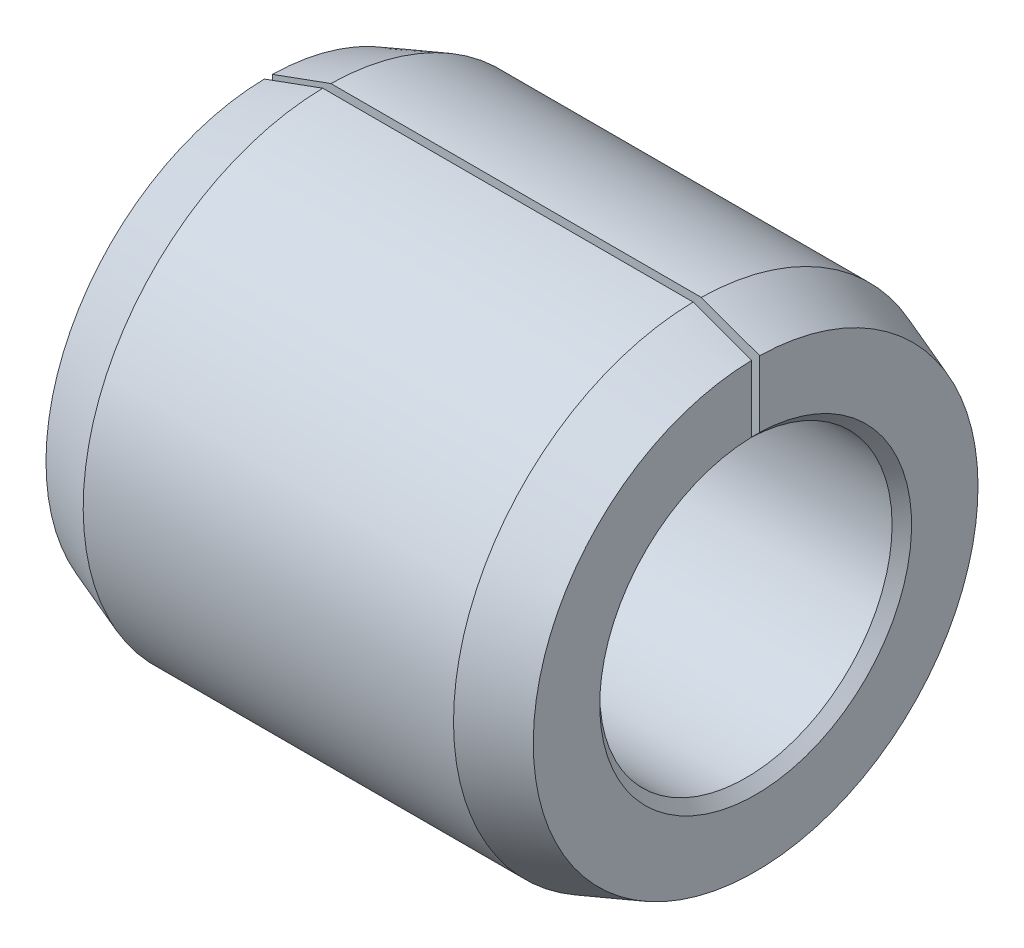
ISO-10303-21;
HEADER;
FILE_DESCRIPTION(('STEP AP214'),'2;1');
FILE_NAME('part.step','',(''),(''),'','','');
FILE_SCHEMA(('AUTOMOTIVE_DESIGN { 1 0 10303 214 1 1 1 1 }'));
ENDSEC;
DATA;
#1=APPLICATION_CONTEXT('core data for automotive mechanical design processes');
#2=APPLICATION_PROTOCOL_DEFINITION('international standard','automotive_design',2000,#1);
#3=PRODUCT_CONTEXT('',#1,'mechanical');
#4=PRODUCT('Part','Part','',(#3));
#5=PRODUCT_RELATED_PRODUCT_CATEGORY('part','',(#4));
#6=PRODUCT_DEFINITION_FORMATION('','',#4);
#7=PRODUCT_DEFINITION_CONTEXT('part definition',#1,'design');
#8=PRODUCT_DEFINITION('design','',#6,#7);
#9=PRODUCT_DEFINITION_SHAPE('','',#8);
#10=(LENGTH_UNIT() NAMED_UNIT(*) SI_UNIT(.MILLI.,.METRE.));
#11=(NAMED_UNIT(*) PLANE_ANGLE_UNIT() SI_UNIT($,.RADIAN.));
#12=(NAMED_UNIT(*) SI_UNIT($,.STERADIAN.) SOLID_ANGLE_UNIT());
#13=UNCERTAINTY_MEASURE_WITH_UNIT(LENGTH_MEASURE(1.E-05),#10,'distance_accuracy_value','');
#14=(GEOMETRIC_REPRESENTATION_CONTEXT(3) GLOBAL_UNCERTAINTY_ASSIGNED_CONTEXT((#13)) GLOBAL_UNIT_ASSIGNED_CONTEXT((#10,
#11,#12)) REPRESENTATION_CONTEXT('',''));
#15=CARTESIAN_POINT('',(0.,0.,0.));
#16=DIRECTION('',(0.,0.,1.));
#17=DIRECTION('',(1.,0.,0.));
#18=AXIS2_PLACEMENT_3D('',#15,#16,#17);
#19=CARTESIAN_POINT('',(5.,0.,0.));
#20=DIRECTION('',(-1.,0.,0.));
#21=DIRECTION('',(0.,0.,1.));
#22=AXIS2_PLACEMENT_3D('',#19,#20,#21);
#23=CONICAL_SURFACE('',#22,2.28161785944028,0.349065850398867);
#24=CARTESIAN_POINT('',(1.45040050652968,3.57332350022328,0.0416666666666667));
#25=CARTESIAN_POINT('',(2.55534017711682,3.17110124417373,0.0416666666666667));
#26=CARTESIAN_POINT('',(3.66029438435063,2.76891890558721,0.0416666666666667));
#27=CARTESIAN_POINT('',(5.31770499377719,2.16558853274691,0.0416666666666667));
#28=CARTESIAN_POINT('',(5.87017174696008,1.96446893087216,0.0416666666666667));
#29=CARTESIAN_POINT('',(6.97509126905575,1.56219131505674,0.0416666666666667));
#30=CARTESIAN_POINT('',(7.5275440379685,1.36103330111602,0.0416666666666667));
#31=CARTESIAN_POINT('',(8.07998627205942,1.15984635289,0.0416666666666667));
#32=B_SPLINE_CURVE_WITH_KNOTS('',3,(#24,#25,#26,#27,#28,#29,#30,#31),.UNSPECIFIED.,.F.,.F.,(4,2,
2,4),(0.,3.52761531923689,5.29142298063087,7.05523064483991),.UNSPECIFIED.);
#33=CARTESIAN_POINT('',(4.4,2.49965275366177,0.0416666666666667));
#34=VERTEX_POINT('',#33);
#35=CARTESIAN_POINT('',(5.,2.28123737156082,0.0416666666666667));
#36=VERTEX_POINT('',#35);
#37=EDGE_CURVE('E176',#34,#36,#32,.T.);
#38=ORIENTED_EDGE('',*,*,#37,.F.);
#39=CARTESIAN_POINT('',(4.4,0.,0.));
#40=DIRECTION('',(-1.,0.,0.));
#41=DIRECTION('',(0.,0.,1.));
#42=AXIS2_PLACEMENT_3D('',#39,#40,#41);
#43=CIRCLE('',#42,2.5);
#44=CARTESIAN_POINT('',(4.4,2.49965275366177,-0.0416666666666667));
#45=VERTEX_POINT('',#44);
#46=EDGE_CURVE('E145',#45,#34,#43,.T.);
#47=ORIENTED_EDGE('',*,*,#46,.F.);
#48=CARTESIAN_POINT('',(8.07998627205942,1.15984635289,-0.0416666666666667));
#49=CARTESIAN_POINT('',(7.53825103993999,1.35713424589462,-0.0416666666666667));
#50=CARTESIAN_POINT('',(6.99650563189232,1.55439419039098,-0.0416666666666667));
#51=CARTESIAN_POINT('',(5.89158664063263,1.9566732642235,-0.0416666666666667));
#52=CARTESIAN_POINT('',(5.32841250813325,2.161690884886,-0.0416666666666667));
#53=CARTESIAN_POINT('',(3.660294321265,2.76891873238838,-0.0416666666666667));
#54=CARTESIAN_POINT('',(2.55534005094122,3.17110089777766,-0.0416666666666667));
#55=CARTESIAN_POINT('',(1.45040050652968,3.57332350022328,-0.0416666666666667));
#56=B_SPLINE_CURVE_WITH_KNOTS('',3,(#48,#49,#50,#51,#52,#53,#54,#55),.UNSPECIFIED.,.F.,.F.,(4,2,
2,4),(0.,1.72962312537501,3.52761532563077,7.05523064486766),.UNSPECIFIED.);
#57=CARTESIAN_POINT('',(5.,2.28123737156082,-0.0416666666666667));
#58=VERTEX_POINT('',#57);
#59=EDGE_CURVE('E47',#58,#45,#56,.T.);
#60=ORIENTED_EDGE('',*,*,#59,.F.);
#61=CARTESIAN_POINT('',(5.,0.,0.));
#62=DIRECTION('',(-1.,0.,0.));
#63=DIRECTION('',(0.,0.,1.));
#64=AXIS2_PLACEMENT_3D('',#61,#62,#63);
#65=CIRCLE('',#64,2.28161785944028);
#66=EDGE_CURVE('E133',#58,#36,#65,.T.);
#67=ORIENTED_EDGE('',*,*,#66,.T.);
#68=EDGE_LOOP('',(#38,#47,#60,#67));
#69=FACE_BOUND('',#68,.T.);
#70=ADVANCED_FACE('F32',(#69),#23,.T.);
#71=CARTESIAN_POINT('',(5.,2.28161785944028,0.));
#72=DIRECTION('',(-1.,0.,0.));
#73=DIRECTION('',(0.,0.,1.));
#74=AXIS2_PLACEMENT_3D('',#71,#72,#73);
#75=PLANE('',#74);
#76=DIRECTION('',(0.,-1.,0.));
#77=VECTOR('',#76,1.);
#78=CARTESIAN_POINT('',(5.,0.,0.0416666666666667));
#79=LINE('',#78,#77);
#80=CARTESIAN_POINT('',(5.,1.5994573732641,0.0416666666666667));
#81=VERTEX_POINT('',#80);
#82=EDGE_CURVE('E105',#36,#81,#79,.T.);
#83=ORIENTED_EDGE('',*,*,#82,.F.);
#84=ORIENTED_EDGE('',*,*,#66,.F.);
#85=DIRECTION('',(0.,1.,0.));
#86=VECTOR('',#85,1.);
#87=CARTESIAN_POINT('',(5.,0.,-0.0416666666666667));
#88=LINE('',#87,#86);
#89=CARTESIAN_POINT('',(5.,1.5994573732641,-0.0416666666666667));
#90=VERTEX_POINT('',#89);
#91=EDGE_CURVE('E142',#90,#58,#88,.T.);
#92=ORIENTED_EDGE('',*,*,#91,.F.);
#93=CARTESIAN_POINT('',(5.,0.,0.));
#94=DIRECTION('',(-1.,0.,0.));
#95=DIRECTION('',(0.,0.,1.));
#96=AXIS2_PLACEMENT_3D('',#93,#94,#95);
#97=CIRCLE('',#96,1.6);
#98=EDGE_CURVE('E130',#90,#81,#97,.T.);
#99=ORIENTED_EDGE('',*,*,#98,.T.);
#100=EDGE_LOOP('',(#83,#84,#92,#99));
#101=FACE_BOUND('',#100,.T.);
#102=ADVANCED_FACE('F210',(#101),#75,.F.);
#103=CARTESIAN_POINT('',(4.9,0.,0.));
#104=DIRECTION('',(1.,0.,0.));
#105=DIRECTION('',(0.,0.,-1.));
#106=AXIS2_PLACEMENT_3D('',#103,#104,#105);
#107=CONICAL_SURFACE('',#106,1.5,0.785398163397447);
#108=CARTESIAN_POINT('',(6.09730448640509,2.69698264385774,0.0416666666666667));
#109=CARTESIAN_POINT('',(5.89362609187549,2.49327428649272,0.0416666666666667));
#110=CARTESIAN_POINT('',(5.68994553688047,2.28956808340359,0.0416666666666667));
#111=CARTESIAN_POINT('',(5.2825975056357,1.8821427164042,0.0416666666666667));
#112=CARTESIAN_POINT('',(5.07893002938226,1.67842355249763,0.0416666666666667));
#113=CARTESIAN_POINT('',(4.77345152579039,1.37282198595637,0.0416666666666667));
#114=CARTESIAN_POINT('',(4.67162911220893,1.27095096279189,0.0416666666666667));
#115=CARTESIAN_POINT('',(4.46799983174415,1.06719341917917,0.0416666666666667));
#116=CARTESIAN_POINT('',(4.3661929648569,0.965306898734846,0.0416666666666667));
#117=CARTESIAN_POINT('',(4.16261826646621,0.761494719920277,0.0416666666666667));
#118=CARTESIAN_POINT('',(4.06085043499734,0.659569061515512,0.0416666666666667));
#119=CARTESIAN_POINT('',(3.90828523322882,0.506593954385333,0.0416666666666667));
#120=CARTESIAN_POINT('',(3.85744455790888,0.455587782958239,0.0416666666666667));
#121=CARTESIAN_POINT('',(3.7558814194517,0.353457766491646,0.0416666666666667));
#122=CARTESIAN_POINT('',(3.7051589565313,0.302333921236636,0.0416666666666667));
#123=CARTESIAN_POINT('',(3.65454036427745,0.251106921321153,0.0416666666666667));
#124=B_SPLINE_CURVE_WITH_KNOTS('',3,(#108,#109,#110,#111,#112,#113,#114,#115,#116,#117,#118,
#119,#120,#121,#122,#123),.UNSPECIFIED.,.F.,.F.,(4,2,2,2,2,2,2,4),(0.,0.864197814810947,
1.72839538549356,2.16049443268804,2.59259337085687,3.02469269095485,3.24074262578335,
3.45679295660717),.UNSPECIFIED.);
#125=CARTESIAN_POINT('',(4.9,1.49942118462055,0.0416666666666667));
#126=VERTEX_POINT('',#125);
#127=EDGE_CURVE('E146',#81,#126,#124,.T.);
#128=ORIENTED_EDGE('',*,*,#127,.F.);
#129=ORIENTED_EDGE('',*,*,#98,.F.);
#130=CARTESIAN_POINT('',(3.65454036427745,0.251106921321153,-0.0416666666666667));
#131=CARTESIAN_POINT('',(3.68946046389026,0.286475381819245,-0.0416666666666667));
#132=CARTESIAN_POINT('',(3.72444534345725,0.32177959674711,-0.0416666666666667));
#133=CARTESIAN_POINT('',(3.79449191026719,0.392311665308783,-0.0416666666666667));
#134=CARTESIAN_POINT('',(3.82955359737814,0.427539519073606,-0.0416666666666667));
#135=CARTESIAN_POINT('',(4.00492184793209,0.60361788518926,-0.0416666666666667));
#136=CARTESIAN_POINT('',(4.14540972760643,0.744287571670683,-0.0416666666666667));
#137=CARTESIAN_POINT('',(4.42642572391524,1.02558711963001,-0.0416666666666667));
#138=CARTESIAN_POINT('',(4.56695384061804,1.16621698103946,-0.0416666666666667));
#139=CARTESIAN_POINT('',(4.76342165526093,1.36278654258166,-0.0416666666666667));
#140=CARTESIAN_POINT('',(4.81934915501475,1.41873841924396,-0.0416666666666667));
#141=CARTESIAN_POINT('',(5.07893042444409,1.67842280412153,-0.0416666666666667));
#142=CARTESIAN_POINT('',(5.28259743419495,1.88214207318682,-0.0416666666666667));
#143=CARTESIAN_POINT('',(5.68994489105734,2.28956800921552,-0.0416666666666667));
#144=CARTESIAN_POINT('',(5.89362533819547,2.49327467615233,-0.0416666666666667));
#145=CARTESIAN_POINT('',(6.09730448640509,2.69698264385774,-0.0416666666666667));
#146=B_SPLINE_CURVE_WITH_KNOTS('',3,(#130,#131,#132,#133,#134,#135,#136,#137,#138,#139,#140,
#141,#142,#143,#144,#145),.UNSPECIFIED.,.F.,.F.,(4,2,2,2,2,2,2,4),(0.,0.149107220578612,
0.298214185127435,0.894639389196668,1.49106561223056,1.72839761263271,2.59259442246702,
3.45679299812628),.UNSPECIFIED.);
#147=CARTESIAN_POINT('',(4.9,1.49942118462055,-0.0416666666666667));
#148=VERTEX_POINT('',#147);
#149=EDGE_CURVE('E198',#148,#90,#146,.T.);
#150=ORIENTED_EDGE('',*,*,#149,.F.);
#151=CARTESIAN_POINT('',(4.9,0.,0.));
#152=DIRECTION('',(-1.,0.,0.));
#153=DIRECTION('',(0.,0.,1.));
#154=AXIS2_PLACEMENT_3D('',#151,#152,#153);
#155=CIRCLE('',#154,1.5);
#156=EDGE_CURVE('E122',#148,#126,#155,.T.);
#157=ORIENTED_EDGE('',*,*,#156,.T.);
#158=EDGE_LOOP('',(#128,#129,#150,#157));
#159=FACE_BOUND('',#158,.T.);
#160=ADVANCED_FACE('F157',(#159),#107,.F.);
#161=CARTESIAN_POINT('',(0.,0.,0.));
#162=DIRECTION('',(-1.,0.,0.));
#163=DIRECTION('',(0.,0.,1.));
#164=AXIS2_PLACEMENT_3D('',#161,#162,#163);
#165=CYLINDRICAL_SURFACE('',#164,1.5);
#166=DIRECTION('',(-1.,0.,0.));
#167=VECTOR('',#166,1.);
#168=CARTESIAN_POINT('',(0.,1.49942118462055,0.0416666666666667));
#169=LINE('',#168,#167);
#170=CARTESIAN_POINT('',(0.0999999999999997,1.49942118462055,0.0416666666666667));
#171=VERTEX_POINT('',#170);
#172=EDGE_CURVE('E155',#126,#171,#169,.T.);
#173=ORIENTED_EDGE('',*,*,#172,.F.);
#174=ORIENTED_EDGE('',*,*,#156,.F.);
#175=DIRECTION('',(-1.,0.,0.));
#176=VECTOR('',#175,1.);
#177=CARTESIAN_POINT('',(0.,1.49942118462055,-0.0416666666666667));
#178=LINE('',#177,#176);
#179=CARTESIAN_POINT('',(0.0999999999999997,1.49942118462055,-0.0416666666666667));
#180=VERTEX_POINT('',#179);
#181=EDGE_CURVE('E116',#180,#148,#178,.F.);
#182=ORIENTED_EDGE('',*,*,#181,.F.);
#183=CARTESIAN_POINT('',(0.0999999999999997,0.,0.));
#184=DIRECTION('',(-1.,0.,0.));
#185=DIRECTION('',(0.,0.,1.));
#186=AXIS2_PLACEMENT_3D('',#183,#184,#185);
#187=CIRCLE('',#186,1.5);
#188=EDGE_CURVE('E115',#180,#171,#187,.T.);
#189=ORIENTED_EDGE('',*,*,#188,.T.);
#190=EDGE_LOOP('',(#173,#174,#182,#189));
#191=FACE_BOUND('',#190,.T.);
#192=ADVANCED_FACE('F188',(#191),#165,.F.);
#193=CARTESIAN_POINT('',(0.,0.,0.));
#194=DIRECTION('',(-1.,0.,0.));
#195=DIRECTION('',(0.,0.,1.));
#196=AXIS2_PLACEMENT_3D('',#193,#194,#195);
#197=CONICAL_SURFACE('',#196,1.6,0.78539816339745);
#198=CARTESIAN_POINT('',(1.34545963572254,0.251106921321151,0.0416666666666667));
#199=CARTESIAN_POINT('',(1.31053953610973,0.286475381819243,0.0416666666666667));
#200=CARTESIAN_POINT('',(1.27555465654274,0.321779596747108,0.0416666666666667));
#201=CARTESIAN_POINT('',(1.20550808973281,0.392311665308781,0.0416666666666667));
#202=CARTESIAN_POINT('',(1.17044640262185,0.427539519073603,0.0416666666666667));
#203=CARTESIAN_POINT('',(0.995078152067913,0.603617885189256,0.0416666666666667));
#204=CARTESIAN_POINT('',(0.85459027239357,0.744287571670679,0.0416666666666667));
#205=CARTESIAN_POINT('',(0.573574276084764,1.02558711963,0.0416666666666667));
#206=CARTESIAN_POINT('',(0.433046159381968,1.16621698103945,0.0416666666666667));
#207=CARTESIAN_POINT('',(0.236578344739075,1.36278654258166,0.0416666666666667));
#208=CARTESIAN_POINT('',(0.180650844985257,1.41873841924396,0.0416666666666667));
#209=CARTESIAN_POINT('',(-0.0789304244440854,1.67842280412153,0.0416666666666667));
#210=CARTESIAN_POINT('',(-0.282597434194944,1.88214207318682,0.0416666666666667));
#211=CARTESIAN_POINT('',(-0.689944891057332,2.28956800921552,0.0416666666666667));
#212=CARTESIAN_POINT('',(-0.893625338195469,2.49327467615233,0.0416666666666667));
#213=CARTESIAN_POINT('',(-1.09730448640508,2.69698264385774,0.0416666666666667));
#214=B_SPLINE_CURVE_WITH_KNOTS('',3,(#198,#199,#200,#201,#202,#203,#204,#205,#206,#207,#208,
#209,#210,#211,#212,#213),.UNSPECIFIED.,.F.,.F.,(4,2,2,2,2,2,2,4),(0.,0.14910722057861,
0.298214185127433,0.894639389196661,1.49106561223055,1.72839761263271,2.59259442246701,
3.45679299812627),.UNSPECIFIED.);
#215=CARTESIAN_POINT('',(0.,1.5994573732641,0.0416666666666667));
#216=VERTEX_POINT('',#215);
#217=EDGE_CURVE('E180',#171,#216,#214,.T.);
#218=ORIENTED_EDGE('',*,*,#217,.F.);
#219=ORIENTED_EDGE('',*,*,#188,.F.);
#220=CARTESIAN_POINT('',(-1.09730448640508,2.69698264385774,-0.0416666666666667));
#221=CARTESIAN_POINT('',(-0.893626091875481,2.49327428649272,-0.0416666666666667));
#222=CARTESIAN_POINT('',(-0.689945536880469,2.28956808340359,-0.0416666666666667));
#223=CARTESIAN_POINT('',(-0.282597505635696,1.8821427164042,-0.0416666666666667));
#224=CARTESIAN_POINT('',(-0.0789300293822553,1.67842355249763,-0.0416666666666667));
#225=CARTESIAN_POINT('',(0.226548474209614,1.37282198595637,-0.0416666666666667));
#226=CARTESIAN_POINT('',(0.328370887791064,1.27095096279189,-0.0416666666666667));
#227=CARTESIAN_POINT('',(0.532000168255847,1.06719341917916,-0.0416666666666667));
#228=CARTESIAN_POINT('',(0.633807035143094,0.965306898734845,-0.0416666666666667));
#229=CARTESIAN_POINT('',(0.837381733533789,0.761494719920275,-0.0416666666666667));
#230=CARTESIAN_POINT('',(0.939149565002653,0.659569061515511,-0.0416666666666667));
#231=CARTESIAN_POINT('',(1.09171476677117,0.506593954385332,-0.0416666666666667));
#232=CARTESIAN_POINT('',(1.14255544209111,0.455587782958237,-0.0416666666666667));
#233=CARTESIAN_POINT('',(1.24411858054829,0.353457766491645,-0.0416666666666667));
#234=CARTESIAN_POINT('',(1.29484104346869,0.302333921236635,-0.0416666666666667));
#235=CARTESIAN_POINT('',(1.34545963572254,0.251106921321151,-0.0416666666666667));
#236=B_SPLINE_CURVE_WITH_KNOTS('',3,(#220,#221,#222,#223,#224,#225,#226,#227,#228,#229,#230,
#231,#232,#233,#234,#235),.UNSPECIFIED.,.F.,.F.,(4,2,2,2,2,2,2,4),(0.,0.864197814810946,
1.72839538549356,2.16049443268803,2.59259337085687,3.02469269095484,3.24074262578334,
3.45679295660717),.UNSPECIFIED.);
#237=CARTESIAN_POINT('',(0.,1.5994573732641,-0.0416666666666667));
#238=VERTEX_POINT('',#237);
#239=EDGE_CURVE('E97',#238,#180,#236,.T.);
#240=ORIENTED_EDGE('',*,*,#239,.F.);
#241=CARTESIAN_POINT('',(0.,0.,0.));
#242=DIRECTION('',(-1.,0.,0.));
#243=DIRECTION('',(0.,0.,1.));
#244=AXIS2_PLACEMENT_3D('',#241,#242,#243);
#245=CIRCLE('',#244,1.6);
#246=EDGE_CURVE('E113',#238,#216,#245,.T.);
#247=ORIENTED_EDGE('',*,*,#246,.T.);
#248=EDGE_LOOP('',(#218,#219,#240,#247));
#249=FACE_BOUND('',#248,.T.);
#250=ADVANCED_FACE('F112',(#249),#197,.F.);
#251=CARTESIAN_POINT('',(0.,1.6,0.));
#252=DIRECTION('',(1.,0.,0.));
#253=DIRECTION('',(0.,0.,-1.));
#254=AXIS2_PLACEMENT_3D('',#251,#252,#253);
#255=PLANE('',#254);
#256=DIRECTION('',(0.,-1.,0.));
#257=VECTOR('',#256,1.);
#258=CARTESIAN_POINT('',(0.,0.,0.0416666666666667));
#259=LINE('',#258,#257);
#260=CARTESIAN_POINT('',(0.,2.28123737156082,0.0416666666666667));
#261=VERTEX_POINT('',#260);
#262=EDGE_CURVE('E106',#261,#216,#259,.T.);
#263=ORIENTED_EDGE('',*,*,#262,.T.);
#264=ORIENTED_EDGE('',*,*,#246,.F.);
#265=DIRECTION('',(0.,1.,0.));
#266=VECTOR('',#265,1.);
#267=CARTESIAN_POINT('',(0.,0.,-0.0416666666666667));
#268=LINE('',#267,#266);
#269=CARTESIAN_POINT('',(0.,2.28123737156082,-0.0416666666666667));
#270=VERTEX_POINT('',#269);
#271=EDGE_CURVE('E94',#238,#270,#268,.T.);
#272=ORIENTED_EDGE('',*,*,#271,.T.);
#273=CARTESIAN_POINT('',(0.,0.,0.));
#274=DIRECTION('',(-1.,0.,0.));
#275=DIRECTION('',(0.,0.,1.));
#276=AXIS2_PLACEMENT_3D('',#273,#274,#275);
#277=CIRCLE('',#276,2.28161785944028);
#278=EDGE_CURVE('E120',#270,#261,#277,.T.);
#279=ORIENTED_EDGE('',*,*,#278,.T.);
#280=EDGE_LOOP('',(#263,#264,#272,#279));
#281=FACE_BOUND('',#280,.T.);
#282=ADVANCED_FACE('F119',(#281),#255,.F.);
#283=CARTESIAN_POINT('',(0.6,0.,0.));
#284=DIRECTION('',(1.,0.,0.));
#285=DIRECTION('',(0.,0.,-1.));
#286=AXIS2_PLACEMENT_3D('',#283,#284,#285);
#287=CONICAL_SURFACE('',#286,2.5,0.349065850398866);
#288=CARTESIAN_POINT('',(-3.07998627205943,1.15984635289,0.0416666666666667));
#289=CARTESIAN_POINT('',(-2.53825103993999,1.35713424589462,0.0416666666666667));
#290=CARTESIAN_POINT('',(-1.99650563189232,1.55439419039098,0.0416666666666667));
#291=CARTESIAN_POINT('',(-0.891586640632624,1.9566732642235,0.0416666666666667));
#292=CARTESIAN_POINT('',(-0.328412508133249,2.161690884886,0.0416666666666667));
#293=CARTESIAN_POINT('',(1.339705678735,2.76891873238838,0.0416666666666667));
#294=CARTESIAN_POINT('',(2.44465994905879,3.17110089777766,0.0416666666666667));
#295=CARTESIAN_POINT('',(3.54959949347032,3.57332350022328,0.0416666666666667));
#296=B_SPLINE_CURVE_WITH_KNOTS('',3,(#288,#289,#290,#291,#292,#293,#294,#295),.UNSPECIFIED.,.F.,
.F.,(4,2,2,4),(0.,1.72962312537502,3.52761532563078,7.05523064486766),.UNSPECIFIED.);
#297=CARTESIAN_POINT('',(0.6,2.49965275366177,0.0416666666666667));
#298=VERTEX_POINT('',#297);
#299=EDGE_CURVE('E54',#261,#298,#296,.T.);
#300=ORIENTED_EDGE('',*,*,#299,.F.);
#301=ORIENTED_EDGE('',*,*,#278,.F.);
#302=CARTESIAN_POINT('',(3.54959949347032,3.57332350022328,-0.0416666666666667));
#303=CARTESIAN_POINT('',(2.44465982288318,3.17110124417373,-0.0416666666666667));
#304=CARTESIAN_POINT('',(1.33970561564937,2.76891890558721,-0.0416666666666667));
#305=CARTESIAN_POINT('',(-0.317704993777192,2.16558853274691,-0.0416666666666667));
#306=CARTESIAN_POINT('',(-0.870171746960085,1.96446893087216,-0.0416666666666667));
#307=CARTESIAN_POINT('',(-1.97509126905575,1.56219131505674,-0.0416666666666667));
#308=CARTESIAN_POINT('',(-2.52754403796851,1.36103330111602,-0.0416666666666667));
#309=CARTESIAN_POINT('',(-3.07998627205943,1.15984635289,-0.0416666666666667));
#310=B_SPLINE_CURVE_WITH_KNOTS('',3,(#302,#303,#304,#305,#306,#307,#308,#309),.UNSPECIFIED.,.F.,
.F.,(4,2,2,4),(0.,3.52761531923689,5.29142298063087,7.05523064483991),.UNSPECIFIED.);
#311=CARTESIAN_POINT('',(0.6,2.49965275366177,-0.0416666666666667));
#312=VERTEX_POINT('',#311);
#313=EDGE_CURVE('E100',#312,#270,#310,.T.);
#314=ORIENTED_EDGE('',*,*,#313,.F.);
#315=CARTESIAN_POINT('',(0.6,0.,0.));
#316=DIRECTION('',(-1.,0.,0.));
#317=DIRECTION('',(0.,0.,1.));
#318=AXIS2_PLACEMENT_3D('',#315,#316,#317);
#319=CIRCLE('',#318,2.5);
#320=EDGE_CURVE('E124',#312,#298,#319,.T.);
#321=ORIENTED_EDGE('',*,*,#320,.T.);
#322=EDGE_LOOP('',(#300,#301,#314,#321));
#323=FACE_BOUND('',#322,.T.);
#324=ADVANCED_FACE('F141',(#323),#287,.T.);
#325=CARTESIAN_POINT('',(0.,0.,0.));
#326=DIRECTION('',(-1.,0.,0.));
#327=DIRECTION('',(0.,0.,1.));
#328=AXIS2_PLACEMENT_3D('',#325,#326,#327);
#329=CYLINDRICAL_SURFACE('',#328,2.5);
#330=DIRECTION('',(-1.,0.,0.));
#331=VECTOR('',#330,1.);
#332=CARTESIAN_POINT('',(0.,2.49965275366177,0.0416666666666667));
#333=LINE('',#332,#331);
#334=EDGE_CURVE('E11',#298,#34,#333,.F.);
#335=ORIENTED_EDGE('',*,*,#334,.F.);
#336=ORIENTED_EDGE('',*,*,#320,.F.);
#337=DIRECTION('',(-1.,0.,0.));
#338=VECTOR('',#337,1.);
#339=CARTESIAN_POINT('',(0.,2.49965275366177,-0.0416666666666667));
#340=LINE('',#339,#338);
#341=EDGE_CURVE('E40',#45,#312,#340,.T.);
#342=ORIENTED_EDGE('',*,*,#341,.F.);
#343=ORIENTED_EDGE('',*,*,#46,.T.);
#344=EDGE_LOOP('',(#335,#336,#342,#343));
#345=FACE_BOUND('',#344,.T.);
#346=ADVANCED_FACE('F144',(#345),#329,.T.);
#347=CARTESIAN_POINT('',(5.,0.,-0.0416666666666667));
#348=DIRECTION('',(0.,0.,1.));
#349=DIRECTION('',(1.,0.,0.));
#350=AXIS2_PLACEMENT_3D('',#347,#348,#349);
#351=PLANE('',#350);
#352=ORIENTED_EDGE('',*,*,#149,.T.);
#353=ORIENTED_EDGE('',*,*,#91,.T.);
#354=ORIENTED_EDGE('',*,*,#59,.T.);
#355=ORIENTED_EDGE('',*,*,#341,.T.);
#356=ORIENTED_EDGE('',*,*,#313,.T.);
#357=ORIENTED_EDGE('',*,*,#271,.F.);
#358=ORIENTED_EDGE('',*,*,#239,.T.);
#359=ORIENTED_EDGE('',*,*,#181,.T.);
#360=EDGE_LOOP('',(#352,#353,#354,#355,#356,#357,#358,#359));
#361=FACE_BOUND('',#360,.T.);
#362=ADVANCED_FACE('F96',(#361),#351,.T.);
#363=CARTESIAN_POINT('',(5.,0.,0.0416666666666667));
#364=DIRECTION('',(0.,0.,-1.));
#365=DIRECTION('',(-1.,0.,0.));
#366=AXIS2_PLACEMENT_3D('',#363,#364,#365);
#367=PLANE('',#366);
#368=ORIENTED_EDGE('',*,*,#127,.T.);
#369=ORIENTED_EDGE('',*,*,#172,.T.);
#370=ORIENTED_EDGE('',*,*,#217,.T.);
#371=ORIENTED_EDGE('',*,*,#262,.F.);
#372=ORIENTED_EDGE('',*,*,#299,.T.);
#373=ORIENTED_EDGE('',*,*,#334,.T.);
#374=ORIENTED_EDGE('',*,*,#37,.T.);
#375=ORIENTED_EDGE('',*,*,#82,.T.);
#376=EDGE_LOOP('',(#368,#369,#370,#371,#372,#373,#374,#375));
#377=FACE_BOUND('',#376,.T.);
#378=ADVANCED_FACE('F160',(#377),#367,.T.);
#379=CLOSED_SHELL('',(#70,#102,#160,#192,#250,#282,#324,#346,#362,#378));
#380=MANIFOLD_SOLID_BREP('B2',#379);
#381=ADVANCED_BREP_SHAPE_REPRESENTATION('',(#18,#380),#14);
#382=SHAPE_DEFINITION_REPRESENTATION(#9,#381);
ENDSEC;
END-ISO-10303-21;
